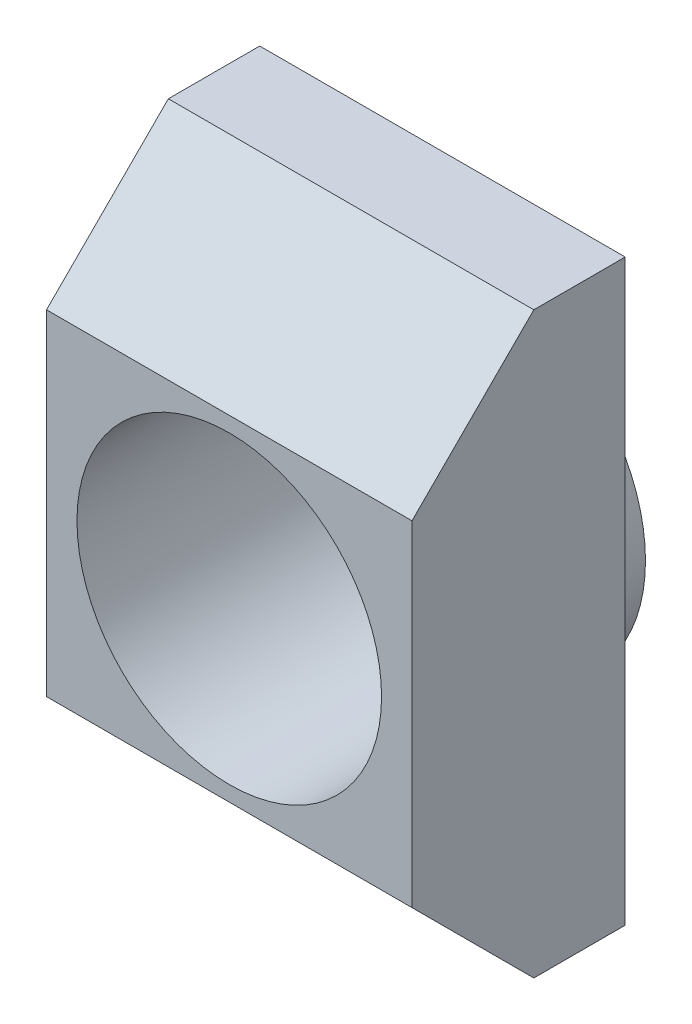
ISO-10303-21;
HEADER;
FILE_DESCRIPTION(('STEP AP214'),'2;1');
FILE_NAME('part.step','',(''),(''),'','','');
FILE_SCHEMA(('AUTOMOTIVE_DESIGN { 1 0 10303 214 1 1 1 1 }'));
ENDSEC;
DATA;
#1=APPLICATION_CONTEXT('core data for automotive mechanical design processes');
#2=APPLICATION_PROTOCOL_DEFINITION('international standard','automotive_design',2000,#1);
#3=PRODUCT_CONTEXT('',#1,'mechanical');
#4=PRODUCT('Part','Part','',(#3));
#5=PRODUCT_RELATED_PRODUCT_CATEGORY('part','',(#4));
#6=PRODUCT_DEFINITION_FORMATION('','',#4);
#7=PRODUCT_DEFINITION_CONTEXT('part definition',#1,'design');
#8=PRODUCT_DEFINITION('design','',#6,#7);
#9=PRODUCT_DEFINITION_SHAPE('','',#8);
#10=(LENGTH_UNIT() NAMED_UNIT(*) SI_UNIT(.MILLI.,.METRE.));
#11=(NAMED_UNIT(*) PLANE_ANGLE_UNIT() SI_UNIT($,.RADIAN.));
#12=(NAMED_UNIT(*) SI_UNIT($,.STERADIAN.) SOLID_ANGLE_UNIT());
#13=UNCERTAINTY_MEASURE_WITH_UNIT(LENGTH_MEASURE(1.E-05),#10,'distance_accuracy_value','');
#14=(GEOMETRIC_REPRESENTATION_CONTEXT(3) GLOBAL_UNCERTAINTY_ASSIGNED_CONTEXT((#13)) GLOBAL_UNIT_ASSIGNED_CONTEXT((#10,
#11,#12)) REPRESENTATION_CONTEXT('',''));
#15=CARTESIAN_POINT('',(0.,0.,0.));
#16=DIRECTION('',(0.,0.,1.));
#17=DIRECTION('',(1.,0.,0.));
#18=AXIS2_PLACEMENT_3D('',#15,#16,#17);
#19=CARTESIAN_POINT('',(0.,0.,2.92902435330802));
#20=DIRECTION('',(0.,0.,-1.));
#21=DIRECTION('',(-1.,0.,0.));
#22=AXIS2_PLACEMENT_3D('',#19,#20,#21);
#23=CYLINDRICAL_SURFACE('',#22,2.5);
#24=CARTESIAN_POINT('',(0.,0.,-1.4372505879018));
#25=DIRECTION('',(0.,0.,-1.));
#26=DIRECTION('',(-1.,0.,0.));
#27=AXIS2_PLACEMENT_3D('',#24,#25,#26);
#28=CIRCLE('',#27,2.5);
#29=CARTESIAN_POINT('',(-2.5,0.,-1.4372505879018));
#30=VERTEX_POINT('',#29);
#31=EDGE_CURVE('E83',#30,#30,#28,.F.);
#32=ORIENTED_EDGE('',*,*,#31,.F.);
#33=EDGE_LOOP('',(#32));
#34=FACE_BOUND('',#33,.T.);
#35=CARTESIAN_POINT('',(0.,0.,2.6627494120982));
#36=DIRECTION('',(0.,0.,-1.));
#37=DIRECTION('',(-1.,0.,0.));
#38=AXIS2_PLACEMENT_3D('',#35,#36,#37);
#39=CIRCLE('',#38,2.5);
#40=CARTESIAN_POINT('',(-2.5,0.,2.6627494120982));
#41=VERTEX_POINT('',#40);
#42=EDGE_CURVE('E19',#41,#41,#39,.F.);
#43=ORIENTED_EDGE('',*,*,#42,.T.);
#44=EDGE_LOOP('',(#43));
#45=FACE_BOUND('',#44,.T.);
#46=ADVANCED_FACE('F16',(#34,#45),#23,.F.);
#47=CARTESIAN_POINT('',(3.,4.75,0.662749412098202));
#48=DIRECTION('',(0.,-0.707106781186548,-0.707106781186548));
#49=DIRECTION('',(0.,0.707106781186548,-0.707106781186548));
#50=AXIS2_PLACEMENT_3D('',#47,#48,#49);
#51=PLANE('',#50);
#52=DIRECTION('',(-1.,0.,0.));
#53=VECTOR('',#52,1.);
#54=CARTESIAN_POINT('',(3.,2.75,2.6627494120982));
#55=LINE('',#54,#53);
#56=CARTESIAN_POINT('',(-3.,2.75,2.6627494120982));
#57=VERTEX_POINT('',#56);
#58=CARTESIAN_POINT('',(3.,2.75,2.6627494120982));
#59=VERTEX_POINT('',#58);
#60=EDGE_CURVE('E102',#57,#59,#55,.F.);
#61=ORIENTED_EDGE('',*,*,#60,.T.);
#62=DIRECTION('',(0.,-0.707106781186548,0.707106781186547));
#63=VECTOR('',#62,1.);
#64=CARTESIAN_POINT('',(3.,4.75,0.662749412098202));
#65=LINE('',#64,#63);
#66=CARTESIAN_POINT('',(3.,4.75,0.662749412098202));
#67=VERTEX_POINT('',#66);
#68=EDGE_CURVE('E66',#67,#59,#65,.T.);
#69=ORIENTED_EDGE('',*,*,#68,.F.);
#70=DIRECTION('',(1.,0.,0.));
#71=VECTOR('',#70,1.);
#72=CARTESIAN_POINT('',(3.,4.75,0.662749412098202));
#73=LINE('',#72,#71);
#74=CARTESIAN_POINT('',(-3.,4.75,0.662749412098202));
#75=VERTEX_POINT('',#74);
#76=EDGE_CURVE('E260',#67,#75,#73,.F.);
#77=ORIENTED_EDGE('',*,*,#76,.T.);
#78=DIRECTION('',(0.,-0.707106781186548,0.707106781186547));
#79=VECTOR('',#78,1.);
#80=CARTESIAN_POINT('',(-3.,4.75,0.662749412098202));
#81=LINE('',#80,#79);
#82=EDGE_CURVE('E269',#75,#57,#81,.T.);
#83=ORIENTED_EDGE('',*,*,#82,.T.);
#84=EDGE_LOOP('',(#61,#69,#77,#83));
#85=FACE_BOUND('',#84,.T.);
#86=ADVANCED_FACE('F115',(#85),#51,.F.);
#87=CARTESIAN_POINT('',(3.,2.75,2.6627494120982));
#88=DIRECTION('',(0.,0.,-1.));
#89=DIRECTION('',(-1.,0.,0.));
#90=AXIS2_PLACEMENT_3D('',#87,#88,#89);
#91=PLANE('',#90);
#92=DIRECTION('',(1.,0.,0.));
#93=VECTOR('',#92,1.);
#94=CARTESIAN_POINT('',(3.,-2.75,2.6627494120982));
#95=LINE('',#94,#93);
#96=CARTESIAN_POINT('',(-3.,-2.75,2.6627494120982));
#97=VERTEX_POINT('',#96);
#98=CARTESIAN_POINT('',(3.,-2.75,2.6627494120982));
#99=VERTEX_POINT('',#98);
#100=EDGE_CURVE('E100',#97,#99,#95,.T.);
#101=ORIENTED_EDGE('',*,*,#100,.T.);
#102=DIRECTION('',(0.,1.,0.));
#103=VECTOR('',#102,1.);
#104=CARTESIAN_POINT('',(3.,0.,2.6627494120982));
#105=LINE('',#104,#103);
#106=EDGE_CURVE('E89',#59,#99,#105,.F.);
#107=ORIENTED_EDGE('',*,*,#106,.F.);
#108=ORIENTED_EDGE('',*,*,#60,.F.);
#109=DIRECTION('',(0.,1.,0.));
#110=VECTOR('',#109,1.);
#111=CARTESIAN_POINT('',(-3.,0.,2.6627494120982));
#112=LINE('',#111,#110);
#113=EDGE_CURVE('E271',#57,#97,#112,.F.);
#114=ORIENTED_EDGE('',*,*,#113,.T.);
#115=EDGE_LOOP('',(#101,#107,#108,#114));
#116=FACE_BOUND('',#115,.T.);
#117=ORIENTED_EDGE('',*,*,#42,.F.);
#118=EDGE_LOOP('',(#117));
#119=FACE_BOUND('',#118,.T.);
#120=ADVANCED_FACE('F119',(#116,#119),#91,.F.);
#121=CARTESIAN_POINT('',(3.,-2.75,2.6627494120982));
#122=DIRECTION('',(0.,0.707106781186548,-0.707106781186548));
#123=DIRECTION('',(0.,0.707106781186548,0.707106781186548));
#124=AXIS2_PLACEMENT_3D('',#121,#122,#123);
#125=PLANE('',#124);
#126=DIRECTION('',(1.,0.,0.));
#127=VECTOR('',#126,1.);
#128=CARTESIAN_POINT('',(3.,-4.75,0.662749412098202));
#129=LINE('',#128,#127);
#130=CARTESIAN_POINT('',(-3.,-4.75,0.662749412098201));
#131=VERTEX_POINT('',#130);
#132=CARTESIAN_POINT('',(3.,-4.75,0.662749412098202));
#133=VERTEX_POINT('',#132);
#134=EDGE_CURVE('E72',#131,#133,#129,.T.);
#135=ORIENTED_EDGE('',*,*,#134,.T.);
#136=DIRECTION('',(0.,-0.707106781186548,-0.707106781186547));
#137=VECTOR('',#136,1.);
#138=CARTESIAN_POINT('',(3.,-2.75,2.6627494120982));
#139=LINE('',#138,#137);
#140=EDGE_CURVE('E75',#99,#133,#139,.T.);
#141=ORIENTED_EDGE('',*,*,#140,.F.);
#142=ORIENTED_EDGE('',*,*,#100,.F.);
#143=DIRECTION('',(0.,-0.707106781186548,-0.707106781186547));
#144=VECTOR('',#143,1.);
#145=CARTESIAN_POINT('',(-3.,-2.75,2.6627494120982));
#146=LINE('',#145,#144);
#147=EDGE_CURVE('E77',#97,#131,#146,.T.);
#148=ORIENTED_EDGE('',*,*,#147,.T.);
#149=EDGE_LOOP('',(#135,#141,#142,#148));
#150=FACE_BOUND('',#149,.T.);
#151=ADVANCED_FACE('F74',(#150),#125,.F.);
#152=CARTESIAN_POINT('',(0.,0.,-1.4372505879018));
#153=DIRECTION('',(0.,0.,-1.));
#154=DIRECTION('',(-1.,0.,0.));
#155=AXIS2_PLACEMENT_3D('',#152,#153,#154);
#156=PLANE('',#155);
#157=ORIENTED_EDGE('',*,*,#31,.T.);
#158=EDGE_LOOP('',(#157));
#159=FACE_BOUND('',#158,.T.);
#160=CARTESIAN_POINT('',(0.,0.,-1.4372505879018));
#161=DIRECTION('',(0.,0.,1.));
#162=DIRECTION('',(1.,0.,0.));
#163=AXIS2_PLACEMENT_3D('',#160,#161,#162);
#164=CIRCLE('',#163,2.7329159209683);
#165=CARTESIAN_POINT('',(2.7329159209683,0.,-1.4372505879018));
#166=VERTEX_POINT('',#165);
#167=EDGE_CURVE('E104',#166,#166,#164,.T.);
#168=ORIENTED_EDGE('',*,*,#167,.F.);
#169=EDGE_LOOP('',(#168));
#170=FACE_BOUND('',#169,.T.);
#171=ADVANCED_FACE('F110',(#159,#170),#156,.T.);
#172=CARTESIAN_POINT('',(3.,-4.75,0.662749412098202));
#173=DIRECTION('',(0.,1.,0.));
#174=DIRECTION('',(0.,0.,1.));
#175=AXIS2_PLACEMENT_3D('',#172,#173,#174);
#176=PLANE('',#175);
#177=DIRECTION('',(1.,0.,0.));
#178=VECTOR('',#177,1.);
#179=CARTESIAN_POINT('',(3.,-4.75,-0.837250587901798));
#180=LINE('',#179,#178);
#181=CARTESIAN_POINT('',(-3.,-4.75,-0.837250587901798));
#182=VERTEX_POINT('',#181);
#183=CARTESIAN_POINT('',(3.,-4.75,-0.837250587901798));
#184=VERTEX_POINT('',#183);
#185=EDGE_CURVE('E95',#182,#184,#180,.T.);
#186=ORIENTED_EDGE('',*,*,#185,.T.);
#187=DIRECTION('',(0.,0.,-1.));
#188=VECTOR('',#187,1.);
#189=CARTESIAN_POINT('',(3.,-4.75,0.));
#190=LINE('',#189,#188);
#191=EDGE_CURVE('E82',#133,#184,#190,.T.);
#192=ORIENTED_EDGE('',*,*,#191,.F.);
#193=ORIENTED_EDGE('',*,*,#134,.F.);
#194=DIRECTION('',(0.,0.,-1.));
#195=VECTOR('',#194,1.);
#196=CARTESIAN_POINT('',(-3.,-4.75,0.));
#197=LINE('',#196,#195);
#198=EDGE_CURVE('E106',#131,#182,#197,.T.);
#199=ORIENTED_EDGE('',*,*,#198,.T.);
#200=EDGE_LOOP('',(#186,#192,#193,#199));
#201=FACE_BOUND('',#200,.T.);
#202=ADVANCED_FACE('F94',(#201),#176,.F.);
#203=CARTESIAN_POINT('',(3.,0.,0.));
#204=DIRECTION('',(1.,0.,0.));
#205=DIRECTION('',(0.,0.,-1.));
#206=AXIS2_PLACEMENT_3D('',#203,#204,#205);
#207=PLANE('',#206);
#208=ORIENTED_EDGE('',*,*,#106,.T.);
#209=ORIENTED_EDGE('',*,*,#140,.T.);
#210=ORIENTED_EDGE('',*,*,#191,.T.);
#211=DIRECTION('',(0.,1.,0.));
#212=VECTOR('',#211,1.);
#213=CARTESIAN_POINT('',(3.,-4.75,-0.837250587901798));
#214=LINE('',#213,#212);
#215=CARTESIAN_POINT('',(3.,4.75,-0.837250587901798));
#216=VERTEX_POINT('',#215);
#217=EDGE_CURVE('E265',#184,#216,#214,.T.);
#218=ORIENTED_EDGE('',*,*,#217,.T.);
#219=DIRECTION('',(0.,0.,-1.));
#220=VECTOR('',#219,1.);
#221=CARTESIAN_POINT('',(3.,4.75,-0.837250587901798));
#222=LINE('',#221,#220);
#223=EDGE_CURVE('E91',#216,#67,#222,.F.);
#224=ORIENTED_EDGE('',*,*,#223,.T.);
#225=ORIENTED_EDGE('',*,*,#68,.T.);
#226=EDGE_LOOP('',(#208,#209,#210,#218,#224,#225));
#227=FACE_BOUND('',#226,.T.);
#228=ADVANCED_FACE('F85',(#227),#207,.T.);
#229=CARTESIAN_POINT('',(3.,4.75,-0.837250587901798));
#230=DIRECTION('',(0.,-1.,0.));
#231=DIRECTION('',(0.,0.,-1.));
#232=AXIS2_PLACEMENT_3D('',#229,#230,#231);
#233=PLANE('',#232);
#234=ORIENTED_EDGE('',*,*,#76,.F.);
#235=ORIENTED_EDGE('',*,*,#223,.F.);
#236=DIRECTION('',(1.,0.,0.));
#237=VECTOR('',#236,1.);
#238=CARTESIAN_POINT('',(3.,4.75,-0.837250587901798));
#239=LINE('',#238,#237);
#240=CARTESIAN_POINT('',(-3.,4.75,-0.837250587901798));
#241=VERTEX_POINT('',#240);
#242=EDGE_CURVE('E278',#216,#241,#239,.F.);
#243=ORIENTED_EDGE('',*,*,#242,.T.);
#244=DIRECTION('',(0.,0.,-1.));
#245=VECTOR('',#244,1.);
#246=CARTESIAN_POINT('',(-3.,4.75,0.));
#247=LINE('',#246,#245);
#248=EDGE_CURVE('E34',#241,#75,#247,.F.);
#249=ORIENTED_EDGE('',*,*,#248,.T.);
#250=EDGE_LOOP('',(#234,#235,#243,#249));
#251=FACE_BOUND('',#250,.T.);
#252=ADVANCED_FACE('F146',(#251),#233,.F.);
#253=CARTESIAN_POINT('',(-3.,0.,0.));
#254=DIRECTION('',(1.,0.,0.));
#255=DIRECTION('',(0.,0.,-1.));
#256=AXIS2_PLACEMENT_3D('',#253,#254,#255);
#257=PLANE('',#256);
#258=ORIENTED_EDGE('',*,*,#147,.F.);
#259=ORIENTED_EDGE('',*,*,#113,.F.);
#260=ORIENTED_EDGE('',*,*,#82,.F.);
#261=ORIENTED_EDGE('',*,*,#248,.F.);
#262=DIRECTION('',(0.,1.,0.));
#263=VECTOR('',#262,1.);
#264=CARTESIAN_POINT('',(-3.,-4.75,-0.837250587901798));
#265=LINE('',#264,#263);
#266=EDGE_CURVE('E25',#241,#182,#265,.F.);
#267=ORIENTED_EDGE('',*,*,#266,.T.);
#268=ORIENTED_EDGE('',*,*,#198,.F.);
#269=EDGE_LOOP('',(#258,#259,#260,#261,#267,#268));
#270=FACE_BOUND('',#269,.T.);
#271=ADVANCED_FACE('F138',(#270),#257,.F.);
#272=CARTESIAN_POINT('',(0.,0.,-1.4372505879018));
#273=DIRECTION('',(0.,0.,1.));
#274=DIRECTION('',(1.,0.,0.));
#275=AXIS2_PLACEMENT_3D('',#272,#273,#274);
#276=CYLINDRICAL_SURFACE('',#275,2.7329159209683);
#277=ORIENTED_EDGE('',*,*,#167,.T.);
#278=EDGE_LOOP('',(#277));
#279=FACE_BOUND('',#278,.T.);
#280=CARTESIAN_POINT('',(0.,0.,-0.837250587901798));
#281=DIRECTION('',(0.,0.,1.));
#282=DIRECTION('',(1.,0.,0.));
#283=AXIS2_PLACEMENT_3D('',#280,#281,#282);
#284=CIRCLE('',#283,2.7329159209683);
#285=CARTESIAN_POINT('',(2.7329159209683,0.,-0.837250587901798));
#286=VERTEX_POINT('',#285);
#287=EDGE_CURVE('E11',#286,#286,#284,.F.);
#288=ORIENTED_EDGE('',*,*,#287,.T.);
#289=EDGE_LOOP('',(#288));
#290=FACE_BOUND('',#289,.T.);
#291=ADVANCED_FACE('F132',(#279,#290),#276,.T.);
#292=CARTESIAN_POINT('',(3.,-4.75,-0.837250587901798));
#293=DIRECTION('',(0.,0.,1.));
#294=DIRECTION('',(1.,0.,0.));
#295=AXIS2_PLACEMENT_3D('',#292,#293,#294);
#296=PLANE('',#295);
#297=ORIENTED_EDGE('',*,*,#287,.F.);
#298=EDGE_LOOP('',(#297));
#299=FACE_BOUND('',#298,.T.);
#300=ORIENTED_EDGE('',*,*,#242,.F.);
#301=ORIENTED_EDGE('',*,*,#217,.F.);
#302=ORIENTED_EDGE('',*,*,#185,.F.);
#303=ORIENTED_EDGE('',*,*,#266,.F.);
#304=EDGE_LOOP('',(#300,#301,#302,#303));
#305=FACE_BOUND('',#304,.T.);
#306=ADVANCED_FACE('F130',(#299,#305),#296,.F.);
#307=CLOSED_SHELL('',(#46,#86,#120,#151,#171,#202,#228,#252,#271,#291,#306));
#308=MANIFOLD_SOLID_BREP('B1',#307);
#309=ADVANCED_BREP_SHAPE_REPRESENTATION('',(#18,#308),#14);
#310=SHAPE_DEFINITION_REPRESENTATION(#9,#309);
ENDSEC;
END-ISO-10303-21;
